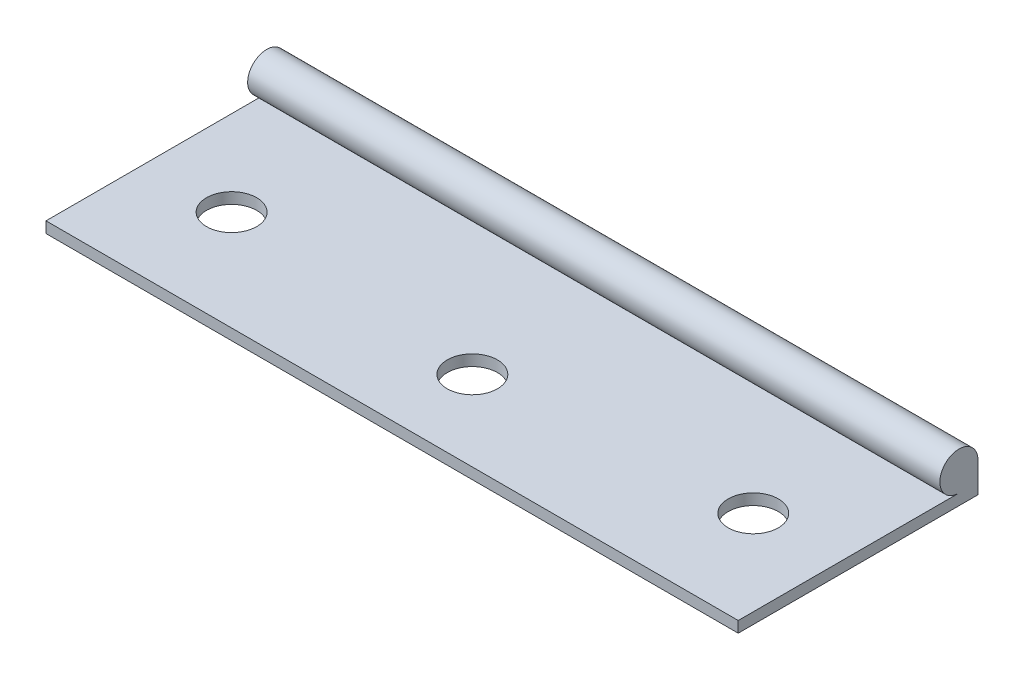
ISO-10303-21;
HEADER;
FILE_DESCRIPTION(('STEP AP214'),'2;1');
FILE_NAME('part.step','',(''),(''),'','','');
FILE_SCHEMA(('AUTOMOTIVE_DESIGN { 1 0 10303 214 1 1 1 1 }'));
ENDSEC;
DATA;
#1=APPLICATION_CONTEXT('core data for automotive mechanical design processes');
#2=APPLICATION_PROTOCOL_DEFINITION('international standard','automotive_design',2000,#1);
#3=PRODUCT_CONTEXT('',#1,'mechanical');
#4=PRODUCT('Part','Part','',(#3));
#5=PRODUCT_RELATED_PRODUCT_CATEGORY('part','',(#4));
#6=PRODUCT_DEFINITION_FORMATION('','',#4);
#7=PRODUCT_DEFINITION_CONTEXT('part definition',#1,'design');
#8=PRODUCT_DEFINITION('design','',#6,#7);
#9=PRODUCT_DEFINITION_SHAPE('','',#8);
#10=(LENGTH_UNIT() NAMED_UNIT(*) SI_UNIT(.MILLI.,.METRE.));
#11=(NAMED_UNIT(*) PLANE_ANGLE_UNIT() SI_UNIT($,.RADIAN.));
#12=(NAMED_UNIT(*) SI_UNIT($,.STERADIAN.) SOLID_ANGLE_UNIT());
#13=UNCERTAINTY_MEASURE_WITH_UNIT(LENGTH_MEASURE(1.E-05),#10,'distance_accuracy_value','');
#14=(GEOMETRIC_REPRESENTATION_CONTEXT(3) GLOBAL_UNCERTAINTY_ASSIGNED_CONTEXT((#13)) GLOBAL_UNIT_ASSIGNED_CONTEXT((#10,
#11,#12)) REPRESENTATION_CONTEXT('',''));
#15=CARTESIAN_POINT('',(0.,0.,0.));
#16=DIRECTION('',(0.,0.,1.));
#17=DIRECTION('',(1.,0.,0.));
#18=AXIS2_PLACEMENT_3D('',#15,#16,#17);
#19=CARTESIAN_POINT('',(69.,3.,-22.));
#20=DIRECTION('',(-1.,0.,0.));
#21=DIRECTION('',(0.,0.,1.));
#22=AXIS2_PLACEMENT_3D('',#19,#20,#21);
#23=CYLINDRICAL_SURFACE('',#22,1.9);
#24=CARTESIAN_POINT('',(0.,3.,-22.));
#25=DIRECTION('',(1.,0.,0.));
#26=DIRECTION('',(0.,0.,-1.));
#27=AXIS2_PLACEMENT_3D('',#24,#25,#26);
#28=CIRCLE('',#27,1.9);
#29=CARTESIAN_POINT('',(0.,3.,-23.9));
#30=VERTEX_POINT('',#29);
#31=CARTESIAN_POINT('',(0.,1.1,-22.));
#32=VERTEX_POINT('',#31);
#33=EDGE_CURVE('E111',#30,#32,#28,.T.);
#34=ORIENTED_EDGE('',*,*,#33,.T.);
#35=DIRECTION('',(-1.,0.,0.));
#36=VECTOR('',#35,1.);
#37=CARTESIAN_POINT('',(69.,1.1,-22.));
#38=LINE('',#37,#36);
#39=CARTESIAN_POINT('',(69.,1.1,-22.));
#40=VERTEX_POINT('',#39);
#41=EDGE_CURVE('E11',#40,#32,#38,.T.);
#42=ORIENTED_EDGE('',*,*,#41,.F.);
#43=CARTESIAN_POINT('',(69.,3.,-22.));
#44=DIRECTION('',(1.,0.,0.));
#45=DIRECTION('',(0.,0.,-1.));
#46=AXIS2_PLACEMENT_3D('',#43,#44,#45);
#47=CIRCLE('',#46,1.9);
#48=CARTESIAN_POINT('',(69.,3.,-23.9));
#49=VERTEX_POINT('',#48);
#50=EDGE_CURVE('E82',#49,#40,#47,.T.);
#51=ORIENTED_EDGE('',*,*,#50,.F.);
#52=DIRECTION('',(-1.,0.,0.));
#53=VECTOR('',#52,1.);
#54=CARTESIAN_POINT('',(69.,3.,-23.9));
#55=LINE('',#54,#53);
#56=EDGE_CURVE('E110',#49,#30,#55,.T.);
#57=ORIENTED_EDGE('',*,*,#56,.T.);
#58=EDGE_LOOP('',(#34,#42,#51,#57));
#59=FACE_BOUND('',#58,.T.);
#60=ADVANCED_FACE('F36',(#59),#23,.T.);
#61=CARTESIAN_POINT('',(69.,1.09999999999999,0.));
#62=DIRECTION('',(0.,1.,0.));
#63=DIRECTION('',(0.,0.,1.));
#64=AXIS2_PLACEMENT_3D('',#61,#62,#63);
#65=PLANE('',#64);
#66=CARTESIAN_POINT('',(60.5,1.09999999999999,-10.));
#67=DIRECTION('',(0.,1.,0.));
#68=DIRECTION('',(0.,0.,1.));
#69=AXIS2_PLACEMENT_3D('',#66,#67,#68);
#70=CIRCLE('',#69,2.5);
#71=CARTESIAN_POINT('',(60.5,1.09999999999999,-7.5));
#72=VERTEX_POINT('',#71);
#73=EDGE_CURVE('E152',#72,#72,#70,.T.);
#74=ORIENTED_EDGE('',*,*,#73,.F.);
#75=EDGE_LOOP('',(#74));
#76=FACE_BOUND('',#75,.T.);
#77=CARTESIAN_POINT('',(34.5,1.09999999999999,-8.));
#78=DIRECTION('',(0.,1.,0.));
#79=DIRECTION('',(0.,0.,1.));
#80=AXIS2_PLACEMENT_3D('',#77,#78,#79);
#81=CIRCLE('',#80,2.5);
#82=CARTESIAN_POINT('',(34.5,1.09999999999999,-5.5));
#83=VERTEX_POINT('',#82);
#84=EDGE_CURVE('E156',#83,#83,#81,.T.);
#85=ORIENTED_EDGE('',*,*,#84,.F.);
#86=EDGE_LOOP('',(#85));
#87=FACE_BOUND('',#86,.T.);
#88=CARTESIAN_POINT('',(8.5,1.09999999999999,-10.));
#89=DIRECTION('',(0.,1.,0.));
#90=DIRECTION('',(0.,0.,1.));
#91=AXIS2_PLACEMENT_3D('',#88,#89,#90);
#92=CIRCLE('',#91,2.5);
#93=CARTESIAN_POINT('',(8.5,1.09999999999999,-7.5));
#94=VERTEX_POINT('',#93);
#95=EDGE_CURVE('E159',#94,#94,#92,.T.);
#96=ORIENTED_EDGE('',*,*,#95,.F.);
#97=EDGE_LOOP('',(#96));
#98=FACE_BOUND('',#97,.T.);
#99=DIRECTION('',(0.,0.,-1.));
#100=VECTOR('',#99,1.);
#101=CARTESIAN_POINT('',(0.,1.09999999999999,0.));
#102=LINE('',#101,#100);
#103=CARTESIAN_POINT('',(0.,1.1,0.));
#104=VERTEX_POINT('',#103);
#105=EDGE_CURVE('E114',#104,#32,#102,.T.);
#106=ORIENTED_EDGE('',*,*,#105,.F.);
#107=DIRECTION('',(-1.,0.,0.));
#108=VECTOR('',#107,1.);
#109=CARTESIAN_POINT('',(69.,1.1,0.));
#110=LINE('',#109,#108);
#111=CARTESIAN_POINT('',(69.,1.1,0.));
#112=VERTEX_POINT('',#111);
#113=EDGE_CURVE('E44',#112,#104,#110,.T.);
#114=ORIENTED_EDGE('',*,*,#113,.F.);
#115=DIRECTION('',(0.,0.,-1.));
#116=VECTOR('',#115,1.);
#117=CARTESIAN_POINT('',(69.,1.09999999999999,0.));
#118=LINE('',#117,#116);
#119=EDGE_CURVE('E104',#112,#40,#118,.T.);
#120=ORIENTED_EDGE('',*,*,#119,.T.);
#121=ORIENTED_EDGE('',*,*,#41,.T.);
#122=EDGE_LOOP('',(#106,#114,#120,#121));
#123=FACE_BOUND('',#122,.T.);
#124=ADVANCED_FACE('F124',(#76,#87,#98,#123),#65,.T.);
#125=CARTESIAN_POINT('',(69.,0.,0.));
#126=DIRECTION('',(0.,0.,1.));
#127=DIRECTION('',(1.,0.,0.));
#128=AXIS2_PLACEMENT_3D('',#125,#126,#127);
#129=PLANE('',#128);
#130=DIRECTION('',(0.,1.,0.));
#131=VECTOR('',#130,1.);
#132=CARTESIAN_POINT('',(0.,0.,0.));
#133=LINE('',#132,#131);
#134=CARTESIAN_POINT('',(0.,0.,0.));
#135=VERTEX_POINT('',#134);
#136=EDGE_CURVE('E96',#135,#104,#133,.T.);
#137=ORIENTED_EDGE('',*,*,#136,.F.);
#138=DIRECTION('',(-1.,0.,0.));
#139=VECTOR('',#138,1.);
#140=CARTESIAN_POINT('',(69.,0.,0.));
#141=LINE('',#140,#139);
#142=CARTESIAN_POINT('',(69.,0.,0.));
#143=VERTEX_POINT('',#142);
#144=EDGE_CURVE('E90',#143,#135,#141,.T.);
#145=ORIENTED_EDGE('',*,*,#144,.F.);
#146=DIRECTION('',(0.,1.,0.));
#147=VECTOR('',#146,1.);
#148=CARTESIAN_POINT('',(69.,0.,0.));
#149=LINE('',#148,#147);
#150=EDGE_CURVE('E94',#143,#112,#149,.T.);
#151=ORIENTED_EDGE('',*,*,#150,.T.);
#152=ORIENTED_EDGE('',*,*,#113,.T.);
#153=EDGE_LOOP('',(#137,#145,#151,#152));
#154=FACE_BOUND('',#153,.T.);
#155=ADVANCED_FACE('F92',(#154),#129,.T.);
#156=CARTESIAN_POINT('',(69.,0.,0.));
#157=DIRECTION('',(0.,1.,0.));
#158=DIRECTION('',(0.,0.,1.));
#159=AXIS2_PLACEMENT_3D('',#156,#157,#158);
#160=PLANE('',#159);
#161=CARTESIAN_POINT('',(60.5,0.,-10.));
#162=DIRECTION('',(0.,1.,0.));
#163=DIRECTION('',(0.,0.,1.));
#164=AXIS2_PLACEMENT_3D('',#161,#162,#163);
#165=CIRCLE('',#164,2.5);
#166=CARTESIAN_POINT('',(60.5,0.,-7.5));
#167=VERTEX_POINT('',#166);
#168=EDGE_CURVE('E161',#167,#167,#165,.T.);
#169=ORIENTED_EDGE('',*,*,#168,.T.);
#170=EDGE_LOOP('',(#169));
#171=FACE_BOUND('',#170,.T.);
#172=CARTESIAN_POINT('',(34.5,0.,-8.));
#173=DIRECTION('',(0.,1.,0.));
#174=DIRECTION('',(0.,0.,1.));
#175=AXIS2_PLACEMENT_3D('',#172,#173,#174);
#176=CIRCLE('',#175,2.5);
#177=CARTESIAN_POINT('',(34.5,0.,-5.5));
#178=VERTEX_POINT('',#177);
#179=EDGE_CURVE('E169',#178,#178,#176,.T.);
#180=ORIENTED_EDGE('',*,*,#179,.T.);
#181=EDGE_LOOP('',(#180));
#182=FACE_BOUND('',#181,.T.);
#183=CARTESIAN_POINT('',(8.5,0.,-10.));
#184=DIRECTION('',(0.,1.,0.));
#185=DIRECTION('',(0.,0.,1.));
#186=AXIS2_PLACEMENT_3D('',#183,#184,#185);
#187=CIRCLE('',#186,2.5);
#188=CARTESIAN_POINT('',(8.5,0.,-7.5));
#189=VERTEX_POINT('',#188);
#190=EDGE_CURVE('E115',#189,#189,#187,.T.);
#191=ORIENTED_EDGE('',*,*,#190,.T.);
#192=EDGE_LOOP('',(#191));
#193=FACE_BOUND('',#192,.T.);
#194=DIRECTION('',(0.,0.,-1.));
#195=VECTOR('',#194,1.);
#196=CARTESIAN_POINT('',(0.,0.,0.));
#197=LINE('',#196,#195);
#198=CARTESIAN_POINT('',(0.,0.,-23.9));
#199=VERTEX_POINT('',#198);
#200=EDGE_CURVE('E70',#135,#199,#197,.T.);
#201=ORIENTED_EDGE('',*,*,#200,.T.);
#202=DIRECTION('',(-1.,0.,0.));
#203=VECTOR('',#202,1.);
#204=CARTESIAN_POINT('',(69.,0.,-23.9));
#205=LINE('',#204,#203);
#206=CARTESIAN_POINT('',(69.,0.,-23.9));
#207=VERTEX_POINT('',#206);
#208=EDGE_CURVE('E97',#207,#199,#205,.T.);
#209=ORIENTED_EDGE('',*,*,#208,.F.);
#210=DIRECTION('',(0.,0.,-1.));
#211=VECTOR('',#210,1.);
#212=CARTESIAN_POINT('',(69.,0.,0.));
#213=LINE('',#212,#211);
#214=EDGE_CURVE('E99',#143,#207,#213,.T.);
#215=ORIENTED_EDGE('',*,*,#214,.F.);
#216=ORIENTED_EDGE('',*,*,#144,.T.);
#217=EDGE_LOOP('',(#201,#209,#215,#216));
#218=FACE_BOUND('',#217,.T.);
#219=ADVANCED_FACE('F100',(#171,#182,#193,#218),#160,.F.);
#220=CARTESIAN_POINT('',(69.,0.,-23.9));
#221=DIRECTION('',(0.,0.,1.));
#222=DIRECTION('',(1.,0.,0.));
#223=AXIS2_PLACEMENT_3D('',#220,#221,#222);
#224=PLANE('',#223);
#225=DIRECTION('',(0.,1.,0.));
#226=VECTOR('',#225,1.);
#227=CARTESIAN_POINT('',(0.,0.,-23.9));
#228=LINE('',#227,#226);
#229=EDGE_CURVE('E76',#199,#30,#228,.T.);
#230=ORIENTED_EDGE('',*,*,#229,.T.);
#231=ORIENTED_EDGE('',*,*,#56,.F.);
#232=DIRECTION('',(0.,1.,0.));
#233=VECTOR('',#232,1.);
#234=CARTESIAN_POINT('',(69.,0.,-23.9));
#235=LINE('',#234,#233);
#236=EDGE_CURVE('E52',#207,#49,#235,.T.);
#237=ORIENTED_EDGE('',*,*,#236,.F.);
#238=ORIENTED_EDGE('',*,*,#208,.T.);
#239=EDGE_LOOP('',(#230,#231,#237,#238));
#240=FACE_BOUND('',#239,.T.);
#241=ADVANCED_FACE('F129',(#240),#224,.F.);
#242=CARTESIAN_POINT('',(69.,0.,0.));
#243=DIRECTION('',(1.,0.,0.));
#244=DIRECTION('',(0.,0.,-1.));
#245=AXIS2_PLACEMENT_3D('',#242,#243,#244);
#246=PLANE('',#245);
#247=ORIENTED_EDGE('',*,*,#50,.T.);
#248=ORIENTED_EDGE('',*,*,#119,.F.);
#249=ORIENTED_EDGE('',*,*,#150,.F.);
#250=ORIENTED_EDGE('',*,*,#214,.T.);
#251=ORIENTED_EDGE('',*,*,#236,.T.);
#252=EDGE_LOOP('',(#247,#248,#249,#250,#251));
#253=FACE_BOUND('',#252,.T.);
#254=ADVANCED_FACE('F102',(#253),#246,.T.);
#255=CARTESIAN_POINT('',(0.,0.,0.));
#256=DIRECTION('',(1.,0.,0.));
#257=DIRECTION('',(0.,0.,-1.));
#258=AXIS2_PLACEMENT_3D('',#255,#256,#257);
#259=PLANE('',#258);
#260=ORIENTED_EDGE('',*,*,#33,.F.);
#261=ORIENTED_EDGE('',*,*,#229,.F.);
#262=ORIENTED_EDGE('',*,*,#200,.F.);
#263=ORIENTED_EDGE('',*,*,#136,.T.);
#264=ORIENTED_EDGE('',*,*,#105,.T.);
#265=EDGE_LOOP('',(#260,#261,#262,#263,#264));
#266=FACE_BOUND('',#265,.T.);
#267=ADVANCED_FACE('F127',(#266),#259,.F.);
#268=CARTESIAN_POINT('',(8.5,0.,-10.));
#269=DIRECTION('',(0.,1.,0.));
#270=DIRECTION('',(0.,0.,1.));
#271=AXIS2_PLACEMENT_3D('',#268,#269,#270);
#272=CYLINDRICAL_SURFACE('',#271,2.5);
#273=ORIENTED_EDGE('',*,*,#190,.F.);
#274=EDGE_LOOP('',(#273));
#275=FACE_BOUND('',#274,.T.);
#276=ORIENTED_EDGE('',*,*,#95,.T.);
#277=EDGE_LOOP('',(#276));
#278=FACE_BOUND('',#277,.T.);
#279=ADVANCED_FACE('F181',(#275,#278),#272,.F.);
#280=CARTESIAN_POINT('',(34.5,0.,-8.));
#281=DIRECTION('',(0.,1.,0.));
#282=DIRECTION('',(0.,0.,1.));
#283=AXIS2_PLACEMENT_3D('',#280,#281,#282);
#284=CYLINDRICAL_SURFACE('',#283,2.5);
#285=ORIENTED_EDGE('',*,*,#179,.F.);
#286=EDGE_LOOP('',(#285));
#287=FACE_BOUND('',#286,.T.);
#288=ORIENTED_EDGE('',*,*,#84,.T.);
#289=EDGE_LOOP('',(#288));
#290=FACE_BOUND('',#289,.T.);
#291=ADVANCED_FACE('F175',(#287,#290),#284,.F.);
#292=CARTESIAN_POINT('',(60.5,0.,-10.));
#293=DIRECTION('',(0.,1.,0.));
#294=DIRECTION('',(0.,0.,1.));
#295=AXIS2_PLACEMENT_3D('',#292,#293,#294);
#296=CYLINDRICAL_SURFACE('',#295,2.5);
#297=ORIENTED_EDGE('',*,*,#168,.F.);
#298=EDGE_LOOP('',(#297));
#299=FACE_BOUND('',#298,.T.);
#300=ORIENTED_EDGE('',*,*,#73,.T.);
#301=EDGE_LOOP('',(#300));
#302=FACE_BOUND('',#301,.T.);
#303=ADVANCED_FACE('F173',(#299,#302),#296,.F.);
#304=CLOSED_SHELL('',(#60,#124,#155,#219,#241,#254,#267,#279,#291,#303));
#305=MANIFOLD_SOLID_BREP('B2',#304);
#306=ADVANCED_BREP_SHAPE_REPRESENTATION('',(#18,#305),#14);
#307=SHAPE_DEFINITION_REPRESENTATION(#9,#306);
ENDSEC;
END-ISO-10303-21;
